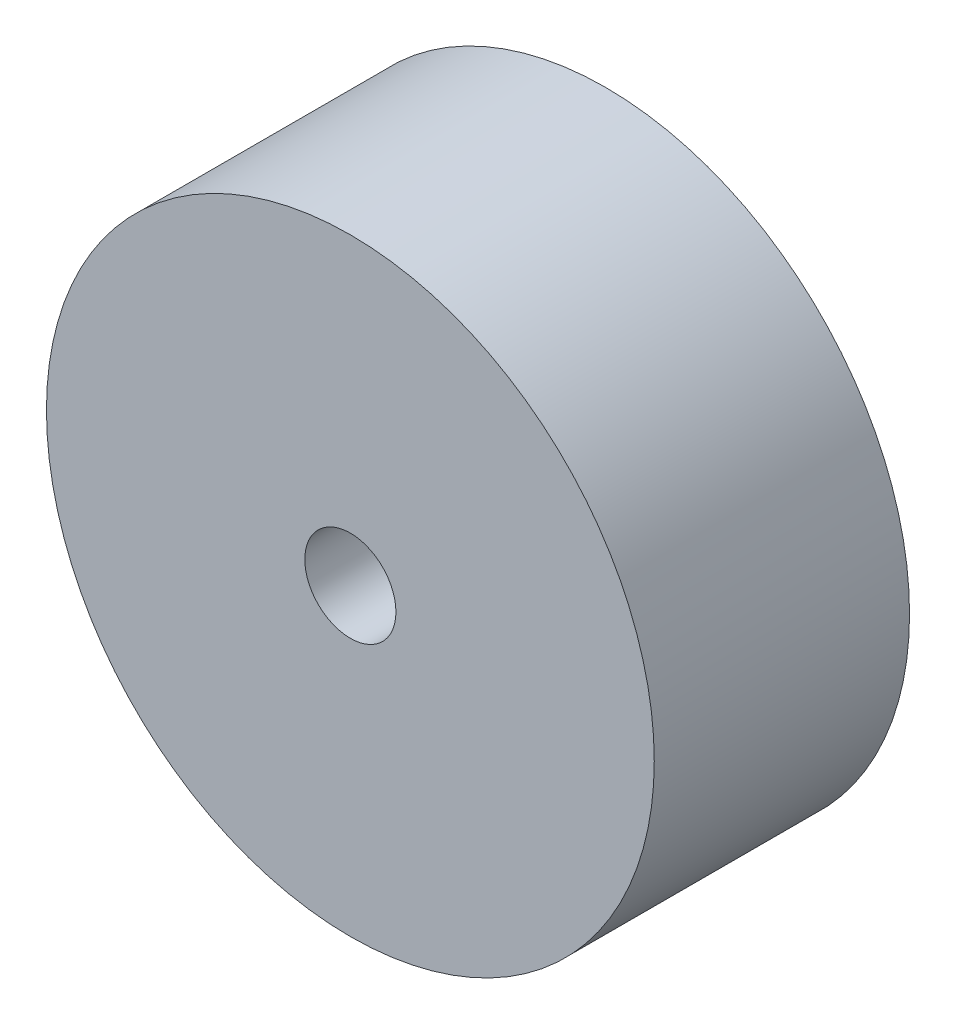
ISO-10303-21;
HEADER;
FILE_DESCRIPTION(('STEP AP214'),'2;1');
FILE_NAME('part.step','',(''),(''),'','','');
FILE_SCHEMA(('AUTOMOTIVE_DESIGN { 1 0 10303 214 1 1 1 1 }'));
ENDSEC;
DATA;
#1=APPLICATION_CONTEXT('core data for automotive mechanical design processes');
#2=APPLICATION_PROTOCOL_DEFINITION('international standard','automotive_design',2000,#1);
#3=PRODUCT_CONTEXT('',#1,'mechanical');
#4=PRODUCT('Part','Part','',(#3));
#5=PRODUCT_RELATED_PRODUCT_CATEGORY('part','',(#4));
#6=PRODUCT_DEFINITION_FORMATION('','',#4);
#7=PRODUCT_DEFINITION_CONTEXT('part definition',#1,'design');
#8=PRODUCT_DEFINITION('design','',#6,#7);
#9=PRODUCT_DEFINITION_SHAPE('','',#8);
#10=(LENGTH_UNIT() NAMED_UNIT(*) SI_UNIT(.MILLI.,.METRE.));
#11=(NAMED_UNIT(*) PLANE_ANGLE_UNIT() SI_UNIT($,.RADIAN.));
#12=(NAMED_UNIT(*) SI_UNIT($,.STERADIAN.) SOLID_ANGLE_UNIT());
#13=UNCERTAINTY_MEASURE_WITH_UNIT(LENGTH_MEASURE(1.E-05),#10,'distance_accuracy_value','');
#14=(GEOMETRIC_REPRESENTATION_CONTEXT(3) GLOBAL_UNCERTAINTY_ASSIGNED_CONTEXT((#13)) GLOBAL_UNIT_ASSIGNED_CONTEXT((#10,
#11,#12)) REPRESENTATION_CONTEXT('',''));
#15=CARTESIAN_POINT('',(0.,0.,0.));
#16=DIRECTION('',(0.,0.,1.));
#17=DIRECTION('',(1.,0.,0.));
#18=AXIS2_PLACEMENT_3D('',#15,#16,#17);
#19=CARTESIAN_POINT('',(0.,0.,42.));
#20=DIRECTION('',(0.,0.,-1.));
#21=DIRECTION('',(-1.,0.,0.));
#22=AXIS2_PLACEMENT_3D('',#19,#20,#21);
#23=CYLINDRICAL_SURFACE('',#22,50.);
#24=CARTESIAN_POINT('',(0.,0.,42.));
#25=DIRECTION('',(0.,0.,1.));
#26=DIRECTION('',(1.,0.,0.));
#27=AXIS2_PLACEMENT_3D('',#24,#25,#26);
#28=CIRCLE('',#27,50.);
#29=CARTESIAN_POINT('',(50.,0.,42.));
#30=VERTEX_POINT('',#29);
#31=EDGE_CURVE('E10',#30,#30,#28,.T.);
#32=ORIENTED_EDGE('',*,*,#31,.F.);
#33=EDGE_LOOP('',(#32));
#34=FACE_BOUND('',#33,.T.);
#35=CARTESIAN_POINT('',(0.,0.,0.));
#36=DIRECTION('',(0.,0.,1.));
#37=DIRECTION('',(1.,0.,0.));
#38=AXIS2_PLACEMENT_3D('',#35,#36,#37);
#39=CIRCLE('',#38,50.);
#40=CARTESIAN_POINT('',(50.,0.,0.));
#41=VERTEX_POINT('',#40);
#42=EDGE_CURVE('E35',#41,#41,#39,.T.);
#43=ORIENTED_EDGE('',*,*,#42,.T.);
#44=EDGE_LOOP('',(#43));
#45=FACE_BOUND('',#44,.T.);
#46=ADVANCED_FACE('F32',(#34,#45),#23,.T.);
#47=CARTESIAN_POINT('',(0.,0.,42.));
#48=DIRECTION('',(0.,0.,1.));
#49=DIRECTION('',(1.,0.,0.));
#50=AXIS2_PLACEMENT_3D('',#47,#48,#49);
#51=PLANE('',#50);
#52=CARTESIAN_POINT('',(0.,0.,42.));
#53=DIRECTION('',(0.,0.,1.));
#54=DIRECTION('',(1.,0.,0.));
#55=AXIS2_PLACEMENT_3D('',#52,#53,#54);
#56=CIRCLE('',#55,7.5);
#57=CARTESIAN_POINT('',(7.5,0.,42.));
#58=VERTEX_POINT('',#57);
#59=EDGE_CURVE('E44',#58,#58,#56,.T.);
#60=ORIENTED_EDGE('',*,*,#59,.F.);
#61=EDGE_LOOP('',(#60));
#62=FACE_BOUND('',#61,.T.);
#63=ORIENTED_EDGE('',*,*,#31,.T.);
#64=EDGE_LOOP('',(#63));
#65=FACE_BOUND('',#64,.T.);
#66=ADVANCED_FACE('F59',(#62,#65),#51,.T.);
#67=CARTESIAN_POINT('',(0.,0.,0.));
#68=DIRECTION('',(0.,0.,1.));
#69=DIRECTION('',(1.,0.,0.));
#70=AXIS2_PLACEMENT_3D('',#67,#68,#69);
#71=PLANE('',#70);
#72=CARTESIAN_POINT('',(0.,0.,0.));
#73=DIRECTION('',(0.,0.,1.));
#74=DIRECTION('',(1.,0.,0.));
#75=AXIS2_PLACEMENT_3D('',#72,#73,#74);
#76=CIRCLE('',#75,7.5);
#77=CARTESIAN_POINT('',(7.5,0.,0.));
#78=VERTEX_POINT('',#77);
#79=EDGE_CURVE('E42',#78,#78,#76,.T.);
#80=ORIENTED_EDGE('',*,*,#79,.T.);
#81=EDGE_LOOP('',(#80));
#82=FACE_BOUND('',#81,.T.);
#83=ORIENTED_EDGE('',*,*,#42,.F.);
#84=EDGE_LOOP('',(#83));
#85=FACE_BOUND('',#84,.T.);
#86=ADVANCED_FACE('F50',(#82,#85),#71,.F.);
#87=CARTESIAN_POINT('',(0.,0.,0.));
#88=DIRECTION('',(0.,0.,1.));
#89=DIRECTION('',(1.,0.,0.));
#90=AXIS2_PLACEMENT_3D('',#87,#88,#89);
#91=CYLINDRICAL_SURFACE('',#90,7.5);
#92=ORIENTED_EDGE('',*,*,#79,.F.);
#93=EDGE_LOOP('',(#92));
#94=FACE_BOUND('',#93,.T.);
#95=ORIENTED_EDGE('',*,*,#59,.T.);
#96=EDGE_LOOP('',(#95));
#97=FACE_BOUND('',#96,.T.);
#98=ADVANCED_FACE('F53',(#94,#97),#91,.F.);
#99=CLOSED_SHELL('',(#46,#66,#86,#98));
#100=MANIFOLD_SOLID_BREP('B2',#99);
#101=ADVANCED_BREP_SHAPE_REPRESENTATION('',(#18,#100),#14);
#102=SHAPE_DEFINITION_REPRESENTATION(#9,#101);
ENDSEC;
END-ISO-10303-21;
